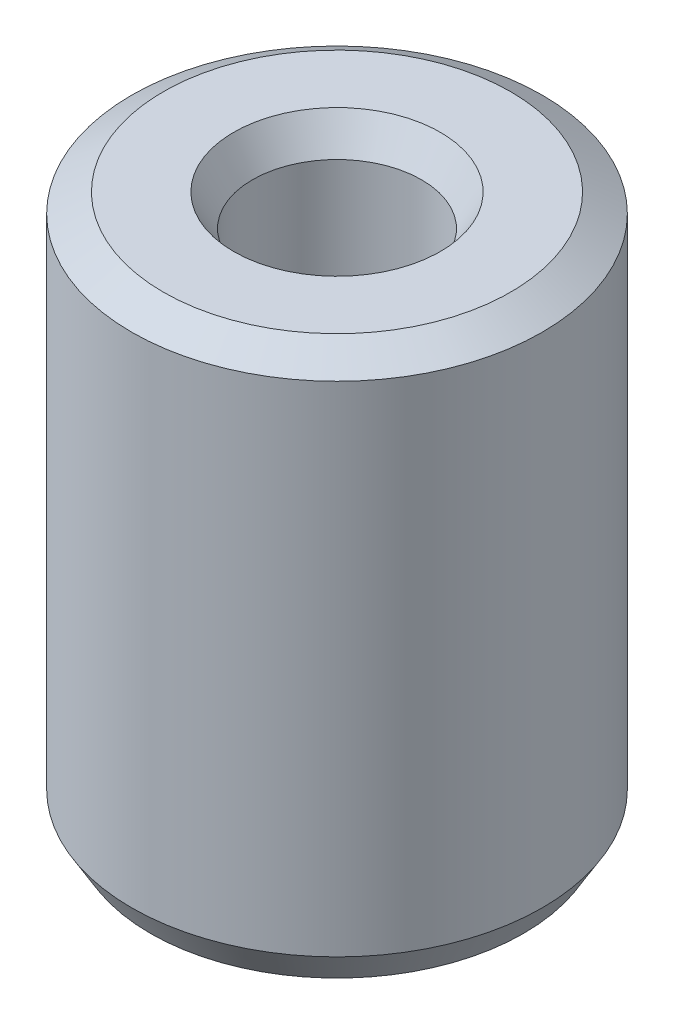
ISO-10303-21;
HEADER;
FILE_DESCRIPTION(('STEP AP214'),'2;1');
FILE_NAME('part.step','',(''),(''),'','','');
FILE_SCHEMA(('AUTOMOTIVE_DESIGN { 1 0 10303 214 1 1 1 1 }'));
ENDSEC;
DATA;
#1=APPLICATION_CONTEXT('core data for automotive mechanical design processes');
#2=APPLICATION_PROTOCOL_DEFINITION('international standard','automotive_design',2000,#1);
#3=PRODUCT_CONTEXT('',#1,'mechanical');
#4=PRODUCT('Part','Part','',(#3));
#5=PRODUCT_RELATED_PRODUCT_CATEGORY('part','',(#4));
#6=PRODUCT_DEFINITION_FORMATION('','',#4);
#7=PRODUCT_DEFINITION_CONTEXT('part definition',#1,'design');
#8=PRODUCT_DEFINITION('design','',#6,#7);
#9=PRODUCT_DEFINITION_SHAPE('','',#8);
#10=(LENGTH_UNIT() NAMED_UNIT(*) SI_UNIT(.MILLI.,.METRE.));
#11=(NAMED_UNIT(*) PLANE_ANGLE_UNIT() SI_UNIT($,.RADIAN.));
#12=(NAMED_UNIT(*) SI_UNIT($,.STERADIAN.) SOLID_ANGLE_UNIT());
#13=UNCERTAINTY_MEASURE_WITH_UNIT(LENGTH_MEASURE(1.E-05),#10,'distance_accuracy_value','');
#14=(GEOMETRIC_REPRESENTATION_CONTEXT(3) GLOBAL_UNCERTAINTY_ASSIGNED_CONTEXT((#13)) GLOBAL_UNIT_ASSIGNED_CONTEXT((#10,
#11,#12)) REPRESENTATION_CONTEXT('',''));
#15=CARTESIAN_POINT('',(0.,0.,0.));
#16=DIRECTION('',(0.,0.,1.));
#17=DIRECTION('',(1.,0.,0.));
#18=AXIS2_PLACEMENT_3D('',#15,#16,#17);
#19=CARTESIAN_POINT('',(0.,20.0534206624746,0.));
#20=DIRECTION('',(0.,-1.,0.));
#21=DIRECTION('',(0.,0.,-1.));
#22=AXIS2_PLACEMENT_3D('',#19,#20,#21);
#23=CYLINDRICAL_SURFACE('',#22,7.5);
#24=CARTESIAN_POINT('',(0.,1.15686903198366,0.));
#25=DIRECTION('',(0.,1.,0.));
#26=DIRECTION('',(0.,0.,1.));
#27=AXIS2_PLACEMENT_3D('',#24,#25,#26);
#28=CIRCLE('',#27,7.5);
#29=CARTESIAN_POINT('',(0.,1.15686903198366,7.5));
#30=VERTEX_POINT('',#29);
#31=EDGE_CURVE('E10',#30,#30,#28,.T.);
#32=ORIENTED_EDGE('',*,*,#31,.T.);
#33=EDGE_LOOP('',(#32));
#34=FACE_BOUND('',#33,.T.);
#35=CARTESIAN_POINT('',(0.,19.3658625897651,0.));
#36=DIRECTION('',(0.,1.,0.));
#37=DIRECTION('',(0.,0.,1.));
#38=AXIS2_PLACEMENT_3D('',#35,#36,#37);
#39=CIRCLE('',#38,7.5);
#40=CARTESIAN_POINT('',(0.,19.3658625897651,7.5));
#41=VERTEX_POINT('',#40);
#42=EDGE_CURVE('E50',#41,#41,#39,.F.);
#43=ORIENTED_EDGE('',*,*,#42,.T.);
#44=EDGE_LOOP('',(#43));
#45=FACE_BOUND('',#44,.T.);
#46=ADVANCED_FACE('F39',(#34,#45),#23,.T.);
#47=CARTESIAN_POINT('',(0.,20.0534206624746,0.));
#48=DIRECTION('',(0.,1.,0.));
#49=DIRECTION('',(0.,0.,1.));
#50=AXIS2_PLACEMENT_3D('',#47,#48,#49);
#51=PLANE('',#50);
#52=CARTESIAN_POINT('',(0.,20.0534206624746,0.));
#53=DIRECTION('',(0.,1.,0.));
#54=DIRECTION('',(0.,0.,1.));
#55=AXIS2_PLACEMENT_3D('',#52,#53,#54);
#56=CIRCLE('',#55,3.77484309298299);
#57=CARTESIAN_POINT('',(0.,20.0534206624746,3.77484309298299));
#58=VERTEX_POINT('',#57);
#59=EDGE_CURVE('E58',#58,#58,#56,.F.);
#60=ORIENTED_EDGE('',*,*,#59,.T.);
#61=EDGE_LOOP('',(#60));
#62=FACE_BOUND('',#61,.T.);
#63=CARTESIAN_POINT('',(0.,20.0534206624746,0.));
#64=DIRECTION('',(0.,1.,0.));
#65=DIRECTION('',(0.,0.,1.));
#66=AXIS2_PLACEMENT_3D('',#63,#64,#65);
#67=CIRCLE('',#66,6.34313096801634);
#68=CARTESIAN_POINT('',(0.,20.0534206624746,6.34313096801634));
#69=VERTEX_POINT('',#68);
#70=EDGE_CURVE('E61',#69,#69,#67,.T.);
#71=ORIENTED_EDGE('',*,*,#70,.T.);
#72=EDGE_LOOP('',(#71));
#73=FACE_BOUND('',#72,.T.);
#74=ADVANCED_FACE('F88',(#62,#73),#51,.T.);
#75=CARTESIAN_POINT('',(0.,0.,0.));
#76=DIRECTION('',(0.,1.,0.));
#77=DIRECTION('',(0.,0.,1.));
#78=AXIS2_PLACEMENT_3D('',#75,#76,#77);
#79=PLANE('',#78);
#80=CARTESIAN_POINT('',(0.,0.,0.));
#81=DIRECTION('',(0.,1.,0.));
#82=DIRECTION('',(0.,0.,1.));
#83=AXIS2_PLACEMENT_3D('',#80,#81,#82);
#84=CIRCLE('',#83,4.24415405225713);
#85=CARTESIAN_POINT('',(0.,0.,4.24415405225713));
#86=VERTEX_POINT('',#85);
#87=EDGE_CURVE('E51',#86,#86,#84,.T.);
#88=ORIENTED_EDGE('',*,*,#87,.T.);
#89=EDGE_LOOP('',(#88));
#90=FACE_BOUND('',#89,.T.);
#91=CARTESIAN_POINT('',(0.,0.,0.));
#92=DIRECTION('',(0.,1.,0.));
#93=DIRECTION('',(0.,0.,1.));
#94=AXIS2_PLACEMENT_3D('',#91,#92,#93);
#95=CIRCLE('',#94,6.81244192729048);
#96=CARTESIAN_POINT('',(0.,0.,6.81244192729048));
#97=VERTEX_POINT('',#96);
#98=EDGE_CURVE('E54',#97,#97,#95,.F.);
#99=ORIENTED_EDGE('',*,*,#98,.T.);
#100=EDGE_LOOP('',(#99));
#101=FACE_BOUND('',#100,.T.);
#102=ADVANCED_FACE('F83',(#90,#101),#79,.F.);
#103=CARTESIAN_POINT('',(0.,20.0534206624746,0.));
#104=DIRECTION('',(0.,-1.,0.));
#105=DIRECTION('',(0.,0.,-1.));
#106=AXIS2_PLACEMENT_3D('',#103,#104,#105);
#107=CYLINDRICAL_SURFACE('',#106,3.08728502027346);
#108=CARTESIAN_POINT('',(0.,18.896551630491,0.));
#109=DIRECTION('',(0.,1.,0.));
#110=DIRECTION('',(0.,0.,1.));
#111=AXIS2_PLACEMENT_3D('',#108,#109,#110);
#112=CIRCLE('',#111,3.08728502027346);
#113=CARTESIAN_POINT('',(0.,18.896551630491,3.08728502027346));
#114=VERTEX_POINT('',#113);
#115=EDGE_CURVE('E67',#114,#114,#112,.T.);
#116=ORIENTED_EDGE('',*,*,#115,.T.);
#117=EDGE_LOOP('',(#116));
#118=FACE_BOUND('',#117,.T.);
#119=CARTESIAN_POINT('',(0.,0.687558072709524,0.));
#120=DIRECTION('',(0.,1.,0.));
#121=DIRECTION('',(0.,0.,1.));
#122=AXIS2_PLACEMENT_3D('',#119,#120,#121);
#123=CIRCLE('',#122,3.08728502027346);
#124=CARTESIAN_POINT('',(0.,0.687558072709524,3.08728502027346));
#125=VERTEX_POINT('',#124);
#126=EDGE_CURVE('E69',#125,#125,#123,.F.);
#127=ORIENTED_EDGE('',*,*,#126,.T.);
#128=EDGE_LOOP('',(#127));
#129=FACE_BOUND('',#128,.T.);
#130=ADVANCED_FACE('F71',(#118,#129),#107,.F.);
#131=CARTESIAN_POINT('',(0.,18.896551630491,0.));
#132=DIRECTION('',(0.,1.,0.));
#133=DIRECTION('',(0.,0.,1.));
#134=AXIS2_PLACEMENT_3D('',#131,#132,#133);
#135=CONICAL_SURFACE('',#134,3.08728502027346,0.536237461268691);
#136=ORIENTED_EDGE('',*,*,#59,.F.);
#137=EDGE_LOOP('',(#136));
#138=FACE_BOUND('',#137,.T.);
#139=ORIENTED_EDGE('',*,*,#115,.F.);
#140=EDGE_LOOP('',(#139));
#141=FACE_BOUND('',#140,.T.);
#142=ADVANCED_FACE('F77',(#138,#141),#135,.F.);
#143=CARTESIAN_POINT('',(0.,0.,0.));
#144=DIRECTION('',(0.,-1.,0.));
#145=DIRECTION('',(0.,0.,-1.));
#146=AXIS2_PLACEMENT_3D('',#143,#144,#145);
#147=CONICAL_SURFACE('',#146,4.24415405225713,1.03455886552621);
#148=ORIENTED_EDGE('',*,*,#126,.F.);
#149=EDGE_LOOP('',(#148));
#150=FACE_BOUND('',#149,.T.);
#151=ORIENTED_EDGE('',*,*,#87,.F.);
#152=EDGE_LOOP('',(#151));
#153=FACE_BOUND('',#152,.T.);
#154=ADVANCED_FACE('F73',(#150,#153),#147,.F.);
#155=CARTESIAN_POINT('',(0.,1.15686903198366,0.));
#156=DIRECTION('',(0.,1.,0.));
#157=DIRECTION('',(0.,0.,1.));
#158=AXIS2_PLACEMENT_3D('',#155,#156,#157);
#159=CONICAL_SURFACE('',#158,7.5,0.536237461268689);
#160=ORIENTED_EDGE('',*,*,#98,.F.);
#161=EDGE_LOOP('',(#160));
#162=FACE_BOUND('',#161,.T.);
#163=ORIENTED_EDGE('',*,*,#31,.F.);
#164=EDGE_LOOP('',(#163));
#165=FACE_BOUND('',#164,.T.);
#166=ADVANCED_FACE('F76',(#162,#165),#159,.T.);
#167=CARTESIAN_POINT('',(0.,20.0534206624746,0.));
#168=DIRECTION('',(0.,-1.,0.));
#169=DIRECTION('',(0.,0.,-1.));
#170=AXIS2_PLACEMENT_3D('',#167,#168,#169);
#171=CONICAL_SURFACE('',#170,6.34313096801634,1.03455886552621);
#172=ORIENTED_EDGE('',*,*,#42,.F.);
#173=EDGE_LOOP('',(#172));
#174=FACE_BOUND('',#173,.T.);
#175=ORIENTED_EDGE('',*,*,#70,.F.);
#176=EDGE_LOOP('',(#175));
#177=FACE_BOUND('',#176,.T.);
#178=ADVANCED_FACE('F45',(#174,#177),#171,.T.);
#179=CLOSED_SHELL('',(#46,#74,#102,#130,#142,#154,#166,#178));
#180=MANIFOLD_SOLID_BREP('B2',#179);
#181=ADVANCED_BREP_SHAPE_REPRESENTATION('',(#18,#180),#14);
#182=SHAPE_DEFINITION_REPRESENTATION(#9,#181);
ENDSEC;
END-ISO-10303-21;
